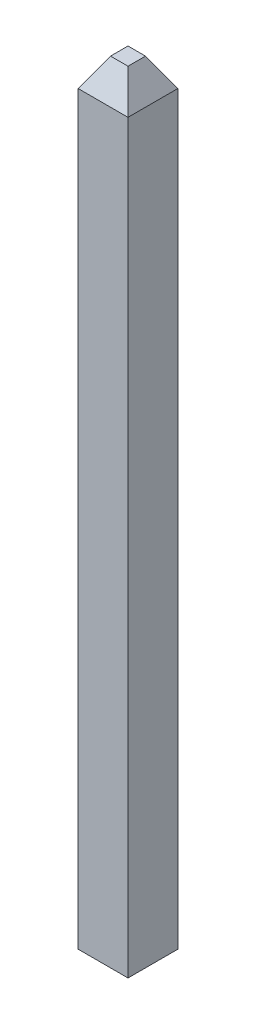
ISO-10303-21;
HEADER;
FILE_DESCRIPTION(('STEP AP214'),'2;1');
FILE_NAME('part.step','',(''),(''),'','','');
FILE_SCHEMA(('AUTOMOTIVE_DESIGN { 1 0 10303 214 1 1 1 1 }'));
ENDSEC;
DATA;
#1=APPLICATION_CONTEXT('core data for automotive mechanical design processes');
#2=APPLICATION_PROTOCOL_DEFINITION('international standard','automotive_design',2000,#1);
#3=PRODUCT_CONTEXT('',#1,'mechanical');
#4=PRODUCT('Part','Part','',(#3));
#5=PRODUCT_RELATED_PRODUCT_CATEGORY('part','',(#4));
#6=PRODUCT_DEFINITION_FORMATION('','',#4);
#7=PRODUCT_DEFINITION_CONTEXT('part definition',#1,'design');
#8=PRODUCT_DEFINITION('design','',#6,#7);
#9=PRODUCT_DEFINITION_SHAPE('','',#8);
#10=(LENGTH_UNIT() NAMED_UNIT(*) SI_UNIT(.MILLI.,.METRE.));
#11=(NAMED_UNIT(*) PLANE_ANGLE_UNIT() SI_UNIT($,.RADIAN.));
#12=(NAMED_UNIT(*) SI_UNIT($,.STERADIAN.) SOLID_ANGLE_UNIT());
#13=UNCERTAINTY_MEASURE_WITH_UNIT(LENGTH_MEASURE(1.E-05),#10,'distance_accuracy_value','');
#14=(GEOMETRIC_REPRESENTATION_CONTEXT(3) GLOBAL_UNCERTAINTY_ASSIGNED_CONTEXT((#13)) GLOBAL_UNIT_ASSIGNED_CONTEXT((#10,
#11,#12)) REPRESENTATION_CONTEXT('',''));
#15=CARTESIAN_POINT('',(0.,0.,0.));
#16=DIRECTION('',(0.,0.,1.));
#17=DIRECTION('',(1.,0.,0.));
#18=AXIS2_PLACEMENT_3D('',#15,#16,#17);
#19=CARTESIAN_POINT('',(0.2032,3.83783,-0.2032));
#20=DIRECTION('',(-0.866025403784429,-0.500000000000017,0.));
#21=DIRECTION('',(0.500000000000017,-0.866025403784429,0.));
#22=AXIS2_PLACEMENT_3D('',#19,#20,#21);
#23=PLANE('',#22);
#24=DIRECTION('',(0.,0.,1.));
#25=VECTOR('',#24,1.);
#26=CARTESIAN_POINT('',(0.2032,3.83783,-0.2032));
#27=LINE('',#26,#25);
#28=CARTESIAN_POINT('',(0.2032,3.83783,0.2032));
#29=VERTEX_POINT('',#28);
#30=CARTESIAN_POINT('',(0.2032,3.83783,-0.203200000000001));
#31=VERTEX_POINT('',#30);
#32=EDGE_CURVE('E19',#29,#31,#27,.F.);
#33=ORIENTED_EDGE('',*,*,#32,.T.);
#34=DIRECTION('',(0.447213595499964,-0.774596669241472,-0.447213595499972));
#35=VECTOR('',#34,1.);
#36=CARTESIAN_POINT('',(0.0712177284632491,4.06643,-0.0712177284632505));
#37=LINE('',#36,#35);
#38=CARTESIAN_POINT('',(0.0712177284632485,4.06643,-0.07121772846325));
#39=VERTEX_POINT('',#38);
#40=EDGE_CURVE('E73',#39,#31,#37,.T.);
#41=ORIENTED_EDGE('',*,*,#40,.F.);
#42=DIRECTION('',(0.,0.,-1.));
#43=VECTOR('',#42,1.);
#44=CARTESIAN_POINT('',(0.0712177284632491,4.06643,-0.2032));
#45=LINE('',#44,#43);
#46=CARTESIAN_POINT('',(0.071217728463248,4.06643,0.0712177284632486));
#47=VERTEX_POINT('',#46);
#48=EDGE_CURVE('E66',#39,#47,#45,.F.);
#49=ORIENTED_EDGE('',*,*,#48,.T.);
#50=DIRECTION('',(0.447213595499964,-0.774596669241472,0.447213595499972));
#51=VECTOR('',#50,1.);
#52=CARTESIAN_POINT('',(0.0712177284632491,4.06643,0.071217728463247));
#53=LINE('',#52,#51);
#54=EDGE_CURVE('E70',#47,#29,#53,.T.);
#55=ORIENTED_EDGE('',*,*,#54,.T.);
#56=EDGE_LOOP('',(#33,#41,#49,#55));
#57=FACE_BOUND('',#56,.T.);
#58=ADVANCED_FACE('F16',(#57),#23,.F.);
#59=CARTESIAN_POINT('',(0.2032,2.9718,-0.2032));
#60=DIRECTION('',(-1.,0.,0.));
#61=DIRECTION('',(0.,0.,1.));
#62=AXIS2_PLACEMENT_3D('',#59,#60,#61);
#63=PLANE('',#62);
#64=DIRECTION('',(0.,1.,0.));
#65=VECTOR('',#64,1.);
#66=CARTESIAN_POINT('',(0.2032,2.9718,0.2032));
#67=LINE('',#66,#65);
#68=CARTESIAN_POINT('',(0.2032,-2.23357,0.2032));
#69=VERTEX_POINT('',#68);
#70=EDGE_CURVE('E99',#29,#69,#67,.F.);
#71=ORIENTED_EDGE('',*,*,#70,.T.);
#72=DIRECTION('',(0.,0.,1.));
#73=VECTOR('',#72,1.);
#74=CARTESIAN_POINT('',(0.2032,-2.23357,0.2032));
#75=LINE('',#74,#73);
#76=CARTESIAN_POINT('',(0.2032,-2.23357,-0.2032));
#77=VERTEX_POINT('',#76);
#78=EDGE_CURVE('E95',#69,#77,#75,.F.);
#79=ORIENTED_EDGE('',*,*,#78,.T.);
#80=DIRECTION('',(0.,1.,0.));
#81=VECTOR('',#80,1.);
#82=CARTESIAN_POINT('',(0.2032,2.9718,-0.2032));
#83=LINE('',#82,#81);
#84=EDGE_CURVE('E89',#31,#77,#83,.F.);
#85=ORIENTED_EDGE('',*,*,#84,.F.);
#86=ORIENTED_EDGE('',*,*,#32,.F.);
#87=EDGE_LOOP('',(#71,#79,#85,#86));
#88=FACE_BOUND('',#87,.T.);
#89=ADVANCED_FACE('F138',(#88),#63,.F.);
#90=CARTESIAN_POINT('',(4.796879710211,3.83783,0.2032));
#91=DIRECTION('',(0.,-0.500000000000017,-0.866025403784429));
#92=DIRECTION('',(0.,0.866025403784429,-0.500000000000017));
#93=AXIS2_PLACEMENT_3D('',#90,#91,#92);
#94=PLANE('',#93);
#95=DIRECTION('',(1.,0.,0.));
#96=VECTOR('',#95,1.);
#97=CARTESIAN_POINT('',(4.796879710211,4.06643,0.0712177284632491));
#98=LINE('',#97,#96);
#99=CARTESIAN_POINT('',(-0.0712177284632501,4.06643,0.071217728463248));
#100=VERTEX_POINT('',#99);
#101=EDGE_CURVE('E75',#47,#100,#98,.F.);
#102=ORIENTED_EDGE('',*,*,#101,.T.);
#103=DIRECTION('',(0.447213595499971,0.774596669241472,-0.447213595499965));
#104=VECTOR('',#103,1.);
#105=CARTESIAN_POINT('',(-0.203200000000003,3.83783,0.2032));
#106=LINE('',#105,#104);
#107=CARTESIAN_POINT('',(-0.2032,3.83783,0.2032));
#108=VERTEX_POINT('',#107);
#109=EDGE_CURVE('E34',#108,#100,#106,.T.);
#110=ORIENTED_EDGE('',*,*,#109,.F.);
#111=DIRECTION('',(-1.,0.,0.));
#112=VECTOR('',#111,1.);
#113=CARTESIAN_POINT('',(4.796879710211,3.83783,0.2032));
#114=LINE('',#113,#112);
#115=EDGE_CURVE('E79',#108,#29,#114,.F.);
#116=ORIENTED_EDGE('',*,*,#115,.T.);
#117=ORIENTED_EDGE('',*,*,#54,.F.);
#118=EDGE_LOOP('',(#102,#110,#116,#117));
#119=FACE_BOUND('',#118,.T.);
#120=ADVANCED_FACE('F77',(#119),#94,.F.);
#121=CARTESIAN_POINT('',(4.796879710211,4.06643,-0.2032));
#122=DIRECTION('',(0.,-1.,0.));
#123=DIRECTION('',(0.,0.,-1.));
#124=AXIS2_PLACEMENT_3D('',#121,#122,#123);
#125=PLANE('',#124);
#126=ORIENTED_EDGE('',*,*,#101,.F.);
#127=ORIENTED_EDGE('',*,*,#48,.F.);
#128=DIRECTION('',(1.,0.,0.));
#129=VECTOR('',#128,1.);
#130=CARTESIAN_POINT('',(4.796879710211,4.06643,-0.07121772846325));
#131=LINE('',#130,#129);
#132=CARTESIAN_POINT('',(-0.0712177284632501,4.06643,-0.0712177284632501));
#133=VERTEX_POINT('',#132);
#134=EDGE_CURVE('E84',#133,#39,#131,.T.);
#135=ORIENTED_EDGE('',*,*,#134,.F.);
#136=DIRECTION('',(0.,0.,1.));
#137=VECTOR('',#136,1.);
#138=CARTESIAN_POINT('',(-0.0712177284632505,4.06643,-0.2032));
#139=LINE('',#138,#137);
#140=EDGE_CURVE('E83',#100,#133,#139,.F.);
#141=ORIENTED_EDGE('',*,*,#140,.F.);
#142=EDGE_LOOP('',(#126,#127,#135,#141));
#143=FACE_BOUND('',#142,.T.);
#144=ADVANCED_FACE('F81',(#143),#125,.F.);
#145=CARTESIAN_POINT('',(4.796879710211,4.06643,-0.07121772846325));
#146=DIRECTION('',(0.,0.500000000000017,-0.866025403784429));
#147=DIRECTION('',(0.,0.866025403784429,0.500000000000017));
#148=AXIS2_PLACEMENT_3D('',#145,#146,#147);
#149=PLANE('',#148);
#150=ORIENTED_EDGE('',*,*,#134,.T.);
#151=ORIENTED_EDGE('',*,*,#40,.T.);
#152=DIRECTION('',(-1.,0.,0.));
#153=VECTOR('',#152,1.);
#154=CARTESIAN_POINT('',(4.796879710211,3.83783,-0.2032));
#155=LINE('',#154,#153);
#156=CARTESIAN_POINT('',(-0.2032,3.83783,-0.203200000000002));
#157=VERTEX_POINT('',#156);
#158=EDGE_CURVE('E92',#157,#31,#155,.F.);
#159=ORIENTED_EDGE('',*,*,#158,.F.);
#160=DIRECTION('',(-0.447213595499971,-0.774596669241471,-0.447213595499966));
#161=VECTOR('',#160,1.);
#162=CARTESIAN_POINT('',(-0.07121772846325,4.06643,-0.07121772846325));
#163=LINE('',#162,#161);
#164=EDGE_CURVE('E106',#133,#157,#163,.T.);
#165=ORIENTED_EDGE('',*,*,#164,.F.);
#166=EDGE_LOOP('',(#150,#151,#159,#165));
#167=FACE_BOUND('',#166,.T.);
#168=ADVANCED_FACE('F128',(#167),#149,.T.);
#169=CARTESIAN_POINT('',(4.796879710211,2.9718,-0.2032));
#170=DIRECTION('',(0.,0.,-1.));
#171=DIRECTION('',(-1.,0.,0.));
#172=AXIS2_PLACEMENT_3D('',#169,#170,#171);
#173=PLANE('',#172);
#174=DIRECTION('',(0.,1.,0.));
#175=VECTOR('',#174,1.);
#176=CARTESIAN_POINT('',(-0.2032,2.9718,-0.203200000000002));
#177=LINE('',#176,#175);
#178=CARTESIAN_POINT('',(-0.2032,-2.23357,-0.2032));
#179=VERTEX_POINT('',#178);
#180=EDGE_CURVE('E109',#157,#179,#177,.F.);
#181=ORIENTED_EDGE('',*,*,#180,.F.);
#182=ORIENTED_EDGE('',*,*,#158,.T.);
#183=ORIENTED_EDGE('',*,*,#84,.T.);
#184=DIRECTION('',(1.,0.,0.));
#185=VECTOR('',#184,1.);
#186=CARTESIAN_POINT('',(0.9954943082875,-2.23357,-0.2032));
#187=LINE('',#186,#185);
#188=EDGE_CURVE('E97',#77,#179,#187,.F.);
#189=ORIENTED_EDGE('',*,*,#188,.T.);
#190=EDGE_LOOP('',(#181,#182,#183,#189));
#191=FACE_BOUND('',#190,.T.);
#192=ADVANCED_FACE('F131',(#191),#173,.T.);
#193=CARTESIAN_POINT('',(0.9954943082875,-2.23357,0.2032));
#194=DIRECTION('',(0.,1.,0.));
#195=DIRECTION('',(0.,0.,1.));
#196=AXIS2_PLACEMENT_3D('',#193,#194,#195);
#197=PLANE('',#196);
#198=DIRECTION('',(0.,0.,1.));
#199=VECTOR('',#198,1.);
#200=CARTESIAN_POINT('',(-0.2032,-2.23357,-0.2032));
#201=LINE('',#200,#199);
#202=CARTESIAN_POINT('',(-0.2032,-2.23357,0.2032));
#203=VERTEX_POINT('',#202);
#204=EDGE_CURVE('E112',#179,#203,#201,.T.);
#205=ORIENTED_EDGE('',*,*,#204,.F.);
#206=ORIENTED_EDGE('',*,*,#188,.F.);
#207=ORIENTED_EDGE('',*,*,#78,.F.);
#208=DIRECTION('',(-1.,0.,0.));
#209=VECTOR('',#208,1.);
#210=CARTESIAN_POINT('',(4.796879710211,-2.23357,0.2032));
#211=LINE('',#210,#209);
#212=EDGE_CURVE('E101',#69,#203,#211,.T.);
#213=ORIENTED_EDGE('',*,*,#212,.T.);
#214=EDGE_LOOP('',(#205,#206,#207,#213));
#215=FACE_BOUND('',#214,.T.);
#216=ADVANCED_FACE('F136',(#215),#197,.F.);
#217=CARTESIAN_POINT('',(4.796879710211,2.9718,0.2032));
#218=DIRECTION('',(0.,0.,-1.));
#219=DIRECTION('',(-1.,0.,0.));
#220=AXIS2_PLACEMENT_3D('',#217,#218,#219);
#221=PLANE('',#220);
#222=DIRECTION('',(0.,1.,0.));
#223=VECTOR('',#222,1.);
#224=CARTESIAN_POINT('',(-0.2032,2.9718,0.2032));
#225=LINE('',#224,#223);
#226=EDGE_CURVE('E25',#203,#108,#225,.T.);
#227=ORIENTED_EDGE('',*,*,#226,.F.);
#228=ORIENTED_EDGE('',*,*,#212,.F.);
#229=ORIENTED_EDGE('',*,*,#70,.F.);
#230=ORIENTED_EDGE('',*,*,#115,.F.);
#231=EDGE_LOOP('',(#227,#228,#229,#230));
#232=FACE_BOUND('',#231,.T.);
#233=ADVANCED_FACE('F123',(#232),#221,.F.);
#234=CARTESIAN_POINT('',(-0.07121772846325,4.06643,-0.2032));
#235=DIRECTION('',(-0.866025403784429,0.500000000000017,0.));
#236=DIRECTION('',(-0.500000000000017,-0.866025403784429,0.));
#237=AXIS2_PLACEMENT_3D('',#234,#235,#236);
#238=PLANE('',#237);
#239=ORIENTED_EDGE('',*,*,#140,.T.);
#240=ORIENTED_EDGE('',*,*,#164,.T.);
#241=DIRECTION('',(0.,0.,1.));
#242=VECTOR('',#241,1.);
#243=CARTESIAN_POINT('',(-0.2032,3.83783,-0.2032));
#244=LINE('',#243,#242);
#245=EDGE_CURVE('E11',#108,#157,#244,.F.);
#246=ORIENTED_EDGE('',*,*,#245,.F.);
#247=ORIENTED_EDGE('',*,*,#109,.T.);
#248=EDGE_LOOP('',(#239,#240,#246,#247));
#249=FACE_BOUND('',#248,.T.);
#250=ADVANCED_FACE('F125',(#249),#238,.T.);
#251=CARTESIAN_POINT('',(-0.2032,2.9718,-0.2032));
#252=DIRECTION('',(-1.,0.,0.));
#253=DIRECTION('',(0.,0.,1.));
#254=AXIS2_PLACEMENT_3D('',#251,#252,#253);
#255=PLANE('',#254);
#256=ORIENTED_EDGE('',*,*,#226,.T.);
#257=ORIENTED_EDGE('',*,*,#245,.T.);
#258=ORIENTED_EDGE('',*,*,#180,.T.);
#259=ORIENTED_EDGE('',*,*,#204,.T.);
#260=EDGE_LOOP('',(#256,#257,#258,#259));
#261=FACE_BOUND('',#260,.T.);
#262=ADVANCED_FACE('F118',(#261),#255,.T.);
#263=CLOSED_SHELL('',(#58,#89,#120,#144,#168,#192,#216,#233,#250,#262));
#264=MANIFOLD_SOLID_BREP('B1',#263);
#265=ADVANCED_BREP_SHAPE_REPRESENTATION('',(#18,#264),#14);
#266=SHAPE_DEFINITION_REPRESENTATION(#9,#265);
ENDSEC;
END-ISO-10303-21;
